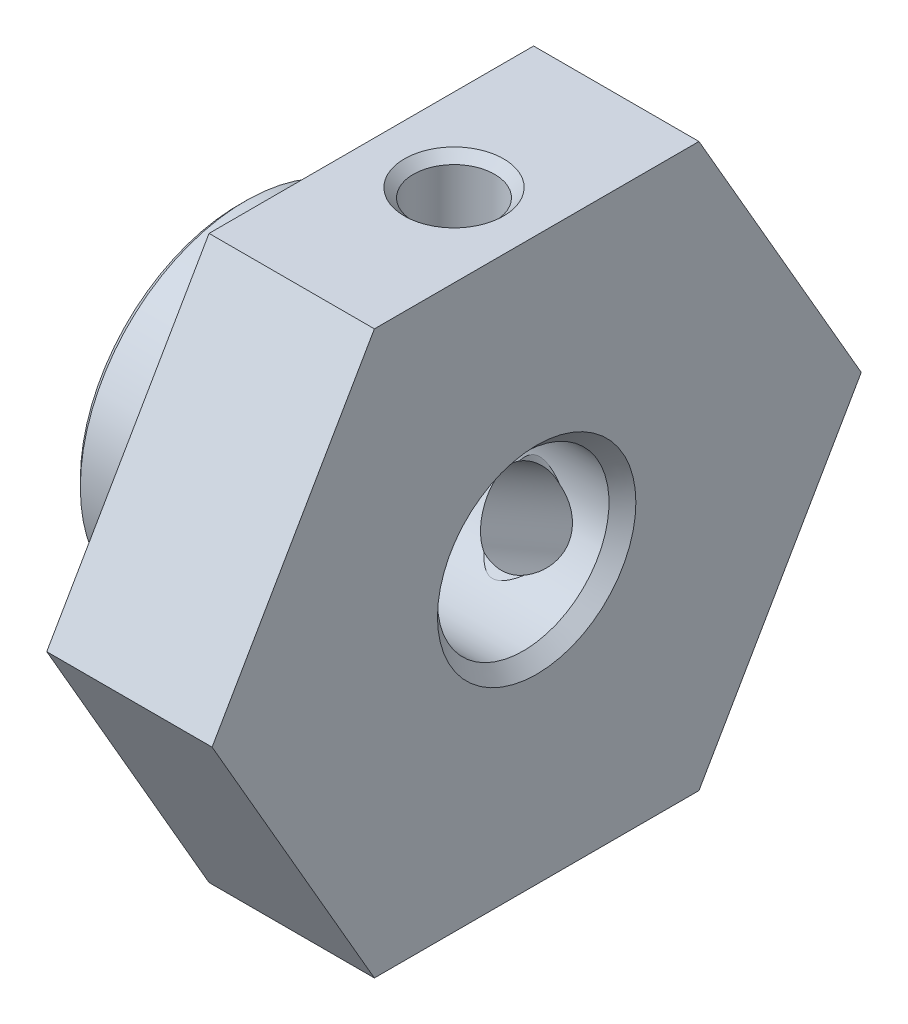
ISO-10303-21;
HEADER;
FILE_DESCRIPTION(('STEP AP214'),'2;1');
FILE_NAME('part.step','',(''),(''),'','','');
FILE_SCHEMA(('AUTOMOTIVE_DESIGN { 1 0 10303 214 1 1 1 1 }'));
ENDSEC;
DATA;
#1=APPLICATION_CONTEXT('core data for automotive mechanical design processes');
#2=APPLICATION_PROTOCOL_DEFINITION('international standard','automotive_design',2000,#1);
#3=PRODUCT_CONTEXT('',#1,'mechanical');
#4=PRODUCT('Part','Part','',(#3));
#5=PRODUCT_RELATED_PRODUCT_CATEGORY('part','',(#4));
#6=PRODUCT_DEFINITION_FORMATION('','',#4);
#7=PRODUCT_DEFINITION_CONTEXT('part definition',#1,'design');
#8=PRODUCT_DEFINITION('design','',#6,#7);
#9=PRODUCT_DEFINITION_SHAPE('','',#8);
#10=(LENGTH_UNIT() NAMED_UNIT(*) SI_UNIT(.MILLI.,.METRE.));
#11=(NAMED_UNIT(*) PLANE_ANGLE_UNIT() SI_UNIT($,.RADIAN.));
#12=(NAMED_UNIT(*) SI_UNIT($,.STERADIAN.) SOLID_ANGLE_UNIT());
#13=UNCERTAINTY_MEASURE_WITH_UNIT(LENGTH_MEASURE(1.E-05),#10,'distance_accuracy_value','');
#14=(GEOMETRIC_REPRESENTATION_CONTEXT(3) GLOBAL_UNCERTAINTY_ASSIGNED_CONTEXT((#13)) GLOBAL_UNIT_ASSIGNED_CONTEXT((#10,
#11,#12)) REPRESENTATION_CONTEXT('',''));
#15=CARTESIAN_POINT('',(0.,0.,0.));
#16=DIRECTION('',(0.,0.,1.));
#17=DIRECTION('',(1.,0.,0.));
#18=AXIS2_PLACEMENT_3D('',#15,#16,#17);
#19=CARTESIAN_POINT('',(9.,0.,0.));
#20=DIRECTION('',(-1.,0.,0.));
#21=DIRECTION('',(0.,0.,1.));
#22=AXIS2_PLACEMENT_3D('',#19,#20,#21);
#23=CYLINDRICAL_SURFACE('',#22,2.594);
#24=CARTESIAN_POINT('',(7.11130557007114,2.3645,1.06675946210943));
#25=CARTESIAN_POINT('',(7.17283329924307,2.3804229380834,1.03150297527811));
#26=CARTESIAN_POINT('',(7.23100469290972,2.39769226485528,0.991096037235716));
#27=CARTESIAN_POINT('',(7.3395891225195,2.43298344496804,0.900970580013275));
#28=CARTESIAN_POINT('',(7.3899853603298,2.45100682359714,0.851232400313027));
#29=CARTESIAN_POINT('',(7.48172195312881,2.48578882449009,0.743569384561638));
#30=CARTESIAN_POINT('',(7.52305827806804,2.50254688174719,0.685640924064241));
#31=CARTESIAN_POINT('',(7.59536277935605,2.53296409349983,0.562947576229603));
#32=CARTESIAN_POINT('',(7.62634213759102,2.54662658494757,0.498190161813476));
#33=CARTESIAN_POINT('',(7.67585190954529,2.56891442894227,0.365864181544286));
#34=CARTESIAN_POINT('',(7.69477657824279,2.57769795200646,0.298470837593822));
#35=CARTESIAN_POINT('',(7.72091963585622,2.58991766875234,0.160977536591798));
#36=CARTESIAN_POINT('',(7.72814352084603,2.59335637296332,0.0908788661333901));
#37=CARTESIAN_POINT('',(7.7304039258054,2.59442907430037,-0.0433039996482899));
#38=CARTESIAN_POINT('',(7.72646568455094,2.59255139670274,-0.107369542585981));
#39=CARTESIAN_POINT('',(7.70875145148675,2.58421839728226,-0.233802702347454));
#40=CARTESIAN_POINT('',(7.69497697513279,2.57776378062347,-0.296170579191969));
#41=CARTESIAN_POINT('',(7.65839685575418,2.56101343778478,-0.416790229436451));
#42=CARTESIAN_POINT('',(7.63570217785813,2.55076499373923,-0.475082584822805));
#43=CARTESIAN_POINT('',(7.58204880060987,2.52733331209461,-0.587114008215008));
#44=CARTESIAN_POINT('',(7.55108450547569,2.51414808827854,-0.640849960491106));
#45=CARTESIAN_POINT('',(7.47904554042583,2.48486031259046,-0.74669317815188));
#46=CARTESIAN_POINT('',(7.43737410431928,2.46861099473553,-0.798352982167304));
#47=CARTESIAN_POINT('',(7.34644987279231,2.43553938828726,-0.894175606907266));
#48=CARTESIAN_POINT('',(7.29720532396884,2.41871773825796,-0.938346473863556));
#49=CARTESIAN_POINT('',(7.20226811547265,2.38929497345709,-1.0106078768721));
#50=CARTESIAN_POINT('',(7.15773519659284,2.37650749911475,-1.04015588903911));
#51=CARTESIAN_POINT('',(7.11130557007114,2.3645,-1.06675946210943));
#52=B_SPLINE_CURVE_WITH_KNOTS('',3,(#24,#25,#26,#27,#28,#29,#30,#31,#32,#33,#34,#35,#36,#37,#38,
#39,#40,#41,#42,#43,#44,#45,#46,#47,#48,#49,#50,#51),.UNSPECIFIED.,.F.,.F.,(4,2,2,2,2,2,2,2,2,2,
2,2,2,4),(0.,0.217712384053668,0.435888737857731,0.65416194524353,0.87219872740545,
1.08267855476251,1.2930594871622,1.48475928203588,1.67642954834547,1.8657873327121,
2.05527357543357,2.25941617927635,2.46333803971736,2.62775890244638),.UNSPECIFIED.);
#53=CARTESIAN_POINT('',(7.11130557007512,2.3645000000015,1.06675946210748));
#54=VERTEX_POINT('',#53);
#55=CARTESIAN_POINT('',(7.11130557007114,2.3645,-1.06675946210943));
#56=VERTEX_POINT('',#55);
#57=EDGE_CURVE('E172',#54,#56,#52,.T.);
#58=ORIENTED_EDGE('',*,*,#57,.T.);
#59=CARTESIAN_POINT('',(7.16108783455756,2.39175,-1.00417525238377));
#60=CARTESIAN_POINT('',(7.13608003947019,2.37788866149612,-1.03721696126421));
#61=CARTESIAN_POINT('',(7.10992590509249,2.36362114904351,-1.06925485586839));
#62=CARTESIAN_POINT('',(7.05493172403082,2.33459008003922,-1.13123488475205));
#63=CARTESIAN_POINT('',(7.02607078006603,2.31982334284631,-1.16115694136222));
#64=CARTESIAN_POINT('',(6.96441720097789,2.2897399994607,-1.21944629923076));
#65=CARTESIAN_POINT('',(6.93151019585101,2.27442641614085,-1.24769511322171));
#66=CARTESIAN_POINT('',(6.86242438203194,2.24477739361206,-1.30027290179945));
#67=CARTESIAN_POINT('',(6.82625925094741,2.23043827138959,-1.32461717049315));
#68=CARTESIAN_POINT('',(6.76409894466059,2.20914823631686,-1.35968895397653));
#69=CARTESIAN_POINT('',(6.7393346976943,2.20143507415852,-1.37211049400494));
#70=CARTESIAN_POINT('',(6.6881944720094,2.187691695571,-1.39391738207763));
#71=CARTESIAN_POINT('',(6.66182937968586,2.181651389609,-1.40332098944318));
#72=CARTESIAN_POINT('',(6.61175544201868,2.172777149557,-1.41701542071826));
#73=CARTESIAN_POINT('',(6.58826998993999,2.16959093868402,-1.42187347582485));
#74=CARTESIAN_POINT('',(6.54065241512918,2.16545325011568,-1.42816790604346));
#75=CARTESIAN_POINT('',(6.51652109668275,2.16449911287724,-1.4296083533062));
#76=CARTESIAN_POINT('',(6.46831317592316,2.16499459796807,-1.42885770511199));
#77=CARTESIAN_POINT('',(6.44423667827866,2.16644719646536,-1.42666211333286));
#78=CARTESIAN_POINT('',(6.39685225175569,2.17150331242237,-1.41895370394312));
#79=CARTESIAN_POINT('',(6.3735454798292,2.17510992493096,-1.41343611294238));
#80=CARTESIAN_POINT('',(6.31675094919156,2.18617969269061,-1.39628120575765));
#81=CARTESIAN_POINT('',(6.28398523047991,2.19466919183898,-1.38296408198598));
#82=CARTESIAN_POINT('',(6.22096050541412,2.21380935145997,-1.35211561707521));
#83=CARTESIAN_POINT('',(6.19072512739402,2.22447773812005,-1.33454947719555));
#84=CARTESIAN_POINT('',(6.12945354585624,2.24810701186622,-1.29439243490119));
#85=CARTESIAN_POINT('',(6.09869150212539,2.26119101610582,-1.271462081225));
#86=CARTESIAN_POINT('',(6.0395945534333,2.28785425328316,-1.2228376503025));
#87=CARTESIAN_POINT('',(6.01126462498815,2.30143442420166,-1.19713813817876));
#88=CARTESIAN_POINT('',(5.95782296739839,2.32804903477104,-1.14449125500444));
#89=CARTESIAN_POINT('',(5.93263075741153,2.34108499624447,-1.11762577711052));
#90=CARTESIAN_POINT('',(5.88429694016077,2.36676686794831,-1.06216200520743));
#91=CARTESIAN_POINT('',(5.86114691842565,2.37941422385326,-1.03357172623689));
#92=CARTESIAN_POINT('',(5.83891216544247,2.39175000000004,-1.00417525238375));
#93=B_SPLINE_CURVE_WITH_KNOTS('',3,(#59,#60,#61,#62,#63,#64,#65,#66,#67,#68,#69,#70,#71,#72,#73,
#74,#75,#76,#77,#78,#79,#80,#81,#82,#83,#84,#85,#86,#87,#88,#89,#90,#91,#92),.UNSPECIFIED.,.F.,
.F.,(4,2,2,2,2,2,2,2,2,2,2,2,2,2,2,2,4),(0.,0.131097506093573,0.26330680666177,
0.401082051116758,0.538303705305195,0.624401304954405,0.709967715530863,0.78224515604404,
0.854436433141115,0.926717048574926,0.999101772932259,1.10760062347554,1.21702008337913,
1.33840819179224,1.46003903788386,1.57714872811023,1.69375084203825),.UNSPECIFIED.);
#94=CARTESIAN_POINT('',(5.88869442992886,2.3645,-1.06675946210943));
#95=VERTEX_POINT('',#94);
#96=EDGE_CURVE('E126',#56,#95,#93,.T.);
#97=ORIENTED_EDGE('',*,*,#96,.T.);
#98=CARTESIAN_POINT('',(5.88869442992886,2.3645,-1.06675946210943));
#99=CARTESIAN_POINT('',(5.82716670075693,2.3804229380834,-1.03150297527811));
#100=CARTESIAN_POINT('',(5.76899530709028,2.39769226485528,-0.991096037235716));
#101=CARTESIAN_POINT('',(5.6604108774805,2.43298344496804,-0.900970580013275));
#102=CARTESIAN_POINT('',(5.6100146396702,2.45100682359714,-0.851232400313027));
#103=CARTESIAN_POINT('',(5.51827804687119,2.48578882449009,-0.743569384561638));
#104=CARTESIAN_POINT('',(5.47694172193196,2.50254688174719,-0.685640924064241));
#105=CARTESIAN_POINT('',(5.40463722064395,2.53296409349983,-0.562947576229603));
#106=CARTESIAN_POINT('',(5.37365786240897,2.54662658494757,-0.498190161813476));
#107=CARTESIAN_POINT('',(5.32414809045471,2.56891442894227,-0.365864181544286));
#108=CARTESIAN_POINT('',(5.30522342175721,2.57769795200646,-0.298470837593822));
#109=CARTESIAN_POINT('',(5.27908036414378,2.58991766875234,-0.160977536591798));
#110=CARTESIAN_POINT('',(5.27185647915397,2.59335637296332,-0.0908788661333902));
#111=CARTESIAN_POINT('',(5.2695960741946,2.59442907430037,0.0433039996482899));
#112=CARTESIAN_POINT('',(5.27353431544906,2.59255139670274,0.107369542585981));
#113=CARTESIAN_POINT('',(5.29124854851325,2.58421839728226,0.233802702347454));
#114=CARTESIAN_POINT('',(5.30502302486721,2.57776378062347,0.296170579191969));
#115=CARTESIAN_POINT('',(5.34160314424582,2.56101343778478,0.416790229436451));
#116=CARTESIAN_POINT('',(5.36429782214187,2.55076499373923,0.475082584822805));
#117=CARTESIAN_POINT('',(5.41795119939013,2.52733331209461,0.587114008215008));
#118=CARTESIAN_POINT('',(5.4489154945243,2.51414808827854,0.640849960491106));
#119=CARTESIAN_POINT('',(5.52095445957417,2.48486031259046,0.74669317815188));
#120=CARTESIAN_POINT('',(5.56262589568072,2.46861099473553,0.798352982167304));
#121=CARTESIAN_POINT('',(5.65355012720769,2.43553938828726,0.894175606907266));
#122=CARTESIAN_POINT('',(5.70279467603116,2.41871773825796,0.938346473863556));
#123=CARTESIAN_POINT('',(5.79773188452735,2.38929497345709,1.0106078768721));
#124=CARTESIAN_POINT('',(5.84226480340716,2.37650749911475,1.04015588903911));
#125=CARTESIAN_POINT('',(5.88869442992886,2.3645,1.06675946210943));
#126=B_SPLINE_CURVE_WITH_KNOTS('',3,(#98,#99,#100,#101,#102,#103,#104,#105,#106,#107,#108,#109,
#110,#111,#112,#113,#114,#115,#116,#117,#118,#119,#120,#121,#122,#123,#124,#125),.UNSPECIFIED.,
.F.,.F.,(4,2,2,2,2,2,2,2,2,2,2,2,2,4),(0.,0.217712384053668,0.435888737857731,0.65416194524353,
0.87219872740545,1.0826785547625,1.2930594871622,1.48475928203588,1.67642954834547,
1.8657873327121,2.05527357543357,2.25941617927635,2.46333803971736,2.62775890244638),.UNSPECIFIED.);
#127=CARTESIAN_POINT('',(5.88869442992886,2.3645,1.06675946210943));
#128=VERTEX_POINT('',#127);
#129=EDGE_CURVE('E128',#95,#128,#126,.T.);
#130=ORIENTED_EDGE('',*,*,#129,.T.);
#131=CARTESIAN_POINT('',(5.83891216544244,2.39175,1.00417525238377));
#132=CARTESIAN_POINT('',(5.86391996052981,2.37788866149612,1.03721696126421));
#133=CARTESIAN_POINT('',(5.89007409490751,2.36362114904351,1.06925485586839));
#134=CARTESIAN_POINT('',(5.94506827596918,2.33459008003922,1.13123488475205));
#135=CARTESIAN_POINT('',(5.97392921993397,2.31982334284631,1.16115694136222));
#136=CARTESIAN_POINT('',(6.03558279902211,2.2897399994607,1.21944629923076));
#137=CARTESIAN_POINT('',(6.06848980414899,2.27442641614085,1.24769511322171));
#138=CARTESIAN_POINT('',(6.13757561796806,2.24477739361206,1.30027290179945));
#139=CARTESIAN_POINT('',(6.17374074905259,2.23043827138959,1.32461717049315));
#140=CARTESIAN_POINT('',(6.23590105533941,2.20914823631686,1.35968895397653));
#141=CARTESIAN_POINT('',(6.2606653023057,2.20143507415852,1.37211049400494));
#142=CARTESIAN_POINT('',(6.3118055279906,2.187691695571,1.39391738207763));
#143=CARTESIAN_POINT('',(6.33817062031414,2.181651389609,1.40332098944318));
#144=CARTESIAN_POINT('',(6.38824455798132,2.172777149557,1.41701542071826));
#145=CARTESIAN_POINT('',(6.41173001006001,2.16959093868402,1.42187347582485));
#146=CARTESIAN_POINT('',(6.45934758487082,2.16545325011568,1.42816790604346));
#147=CARTESIAN_POINT('',(6.48347890331725,2.16449911287724,1.4296083533062));
#148=CARTESIAN_POINT('',(6.53168682407684,2.16499459796807,1.42885770511199));
#149=CARTESIAN_POINT('',(6.55576332172134,2.16644719646536,1.42666211333286));
#150=CARTESIAN_POINT('',(6.60314774824431,2.17150331242237,1.41895370394312));
#151=CARTESIAN_POINT('',(6.6264545201708,2.17510992493096,1.41343611294238));
#152=CARTESIAN_POINT('',(6.68324905080844,2.18617969269061,1.39628120575765));
#153=CARTESIAN_POINT('',(6.71601476952009,2.19466919183898,1.38296408198598));
#154=CARTESIAN_POINT('',(6.77903949458588,2.21380935145997,1.35211561707521));
#155=CARTESIAN_POINT('',(6.80927487260598,2.22447773812005,1.33454947719555));
#156=CARTESIAN_POINT('',(6.87054645414376,2.24810701186622,1.29439243490119));
#157=CARTESIAN_POINT('',(6.90130849787461,2.26119101610582,1.271462081225));
#158=CARTESIAN_POINT('',(6.9604054465667,2.28785425328316,1.2228376503025));
#159=CARTESIAN_POINT('',(6.98873537501185,2.30143442420166,1.19713813817876));
#160=CARTESIAN_POINT('',(7.0421770326016,2.32804903477104,1.14449125500444));
#161=CARTESIAN_POINT('',(7.06736924258847,2.34108499624447,1.11762577711052));
#162=CARTESIAN_POINT('',(7.11570305983923,2.36676686794831,1.06216200520743));
#163=CARTESIAN_POINT('',(7.13885308157434,2.37941422385326,1.03357172623689));
#164=CARTESIAN_POINT('',(7.16108783455752,2.39175000000004,1.00417525238375));
#165=B_SPLINE_CURVE_WITH_KNOTS('',3,(#131,#132,#133,#134,#135,#136,#137,#138,#139,#140,#141,
#142,#143,#144,#145,#146,#147,#148,#149,#150,#151,#152,#153,#154,#155,#156,#157,#158,#159,#160,
#161,#162,#163,#164),.UNSPECIFIED.,.F.,.F.,(4,2,2,2,2,2,2,2,2,2,2,2,2,2,2,2,4),(0.,
0.131097506093572,0.26330680666177,0.401082051116758,0.538303705305195,0.624401304954403,
0.709967715530863,0.78224515604404,0.854436433141115,0.926717048574927,0.999101772932259,
1.10760062347554,1.21702008337913,1.33840819179224,1.46003903788386,1.57714872811023,
1.69375084203825),.UNSPECIFIED.);
#166=EDGE_CURVE('E165',#128,#54,#165,.T.);
#167=ORIENTED_EDGE('',*,*,#166,.T.);
#168=EDGE_LOOP('',(#58,#97,#130,#167));
#169=FACE_BOUND('',#168,.T.);
#170=CARTESIAN_POINT('',(0.406,0.,0.));
#171=DIRECTION('',(-1.,0.,0.));
#172=DIRECTION('',(0.,0.,1.));
#173=AXIS2_PLACEMENT_3D('',#170,#171,#172);
#174=CIRCLE('',#173,2.594);
#175=CARTESIAN_POINT('',(0.406,0.,2.594));
#176=VERTEX_POINT('',#175);
#177=EDGE_CURVE('E242',#176,#176,#174,.T.);
#178=ORIENTED_EDGE('',*,*,#177,.T.);
#179=EDGE_LOOP('',(#178));
#180=FACE_BOUND('',#179,.T.);
#181=CARTESIAN_POINT('',(8.594,0.,0.));
#182=DIRECTION('',(-1.,0.,0.));
#183=DIRECTION('',(0.,0.,1.));
#184=AXIS2_PLACEMENT_3D('',#181,#182,#183);
#185=CIRCLE('',#184,2.594);
#186=CARTESIAN_POINT('',(8.594,0.,2.594));
#187=VERTEX_POINT('',#186);
#188=EDGE_CURVE('E239',#187,#187,#185,.T.);
#189=ORIENTED_EDGE('',*,*,#188,.F.);
#190=EDGE_LOOP('',(#189));
#191=FACE_BOUND('',#190,.T.);
#192=CARTESIAN_POINT('',(5.88869442992874,-2.10609079391417,-1.51433733619361));
#193=CARTESIAN_POINT('',(5.82716670075681,-2.08351924971175,-1.54575524849239));
#194=CARTESIAN_POINT('',(5.76899530709017,-2.05716047826383,-1.5809143932043));
#195=CARTESIAN_POINT('',(5.66041087748039,-1.99675513283788,-1.65654018032271));
#196=CARTESIAN_POINT('',(5.6100146396701,-1.96269229499402,-1.69701797392766));
#197=CARTESIAN_POINT('',(5.5182780468711,-1.88684438875173,-1.78097157817111));
#198=CARTESIAN_POINT('',(5.47694172193187,-1.84505589898741,-1.82444871172253));
#199=CARTESIAN_POINT('',(5.40463722064387,-1.75400894876356,-1.91213746372993));
#200=CARTESIAN_POINT('',(5.3736578624089,-1.70475862851967,-1.95634823561073));
#201=CARTESIAN_POINT('',(5.32414809045465,-1.60130489002321,-2.04181306484032));
#202=CARTESIAN_POINT('',(5.30522342175715,-1.54733230364822,-2.08311649092387));
#203=CARTESIAN_POINT('',(5.27908036414373,-1.43436947050322,-2.16244572655386));
#204=CARTESIAN_POINT('',(5.27185647915394,-1.37538159322021,-2.20047306698586));
#205=CARTESIAN_POINT('',(5.26959607419458,-1.2597121733692,-2.26849348648526));
#206=CARTESIAN_POINT('',(5.27353431544904,-1.2032909468791,-2.29890014145443));
#207=CARTESIAN_POINT('',(5.29124854851325,-1.08963011893469,-2.35490013214732));
#208=CARTESIAN_POINT('',(5.30502302486721,-1.03239064487785,-2.38049420857136));
#209=CARTESIAN_POINT('',(5.34160314424583,-0.919555792151185,-2.4262978112732));
#210=CARTESIAN_POINT('',(5.36429782214189,-0.863948909517396,-2.44656857607366));
#211=CARTESIAN_POINT('',(5.41795119939015,-0.75521101001531,-2.48229185621213));
#212=CARTESIAN_POINT('',(5.44891549452433,-0.702081698339623,-2.49774109357087));
#213=CARTESIAN_POINT('',(5.52095445957421,-0.595774895183066,-2.52529874463504));
#214=CARTESIAN_POINT('',(5.56262589568077,-0.542911533623723,-2.53705632458622));
#215=CARTESIAN_POINT('',(5.65355012720775,-0.443390903117478,-2.55632678562803));
#216=CARTESIAN_POINT('',(5.70279467603122,-0.396726985211499,-2.56384424284722));
#217=CARTESIAN_POINT('',(5.79773188452737,-0.319435392092613,-2.57449408258436));
#218=CARTESIAN_POINT('',(5.84226480340712,-0.287452325753515,-2.57819381103715));
#219=CARTESIAN_POINT('',(5.88869442992876,-0.258409206085846,-2.58109679830302));
#220=B_SPLINE_CURVE_WITH_KNOTS('',3,(#192,#193,#194,#195,#196,#197,#198,#199,#200,#201,#202,
#203,#204,#205,#206,#207,#208,#209,#210,#211,#212,#213,#214,#215,#216,#217,#218,#219),
.UNSPECIFIED.,.F.,.F.,(4,2,2,2,2,2,2,2,2,2,2,2,2,4),(0.,0.217712384053673,0.43588873785774,
0.654161945243546,0.872198727405472,1.08267855476253,1.29305948716222,1.4847592820359,
1.67642954834549,1.86578733271212,2.0552735754336,2.25941617927639,2.46333803971741,
2.62775890244621),.UNSPECIFIED.);
#221=CARTESIAN_POINT('',(5.88869442992875,-2.10609079391417,-1.51433733619361));
#222=VERTEX_POINT('',#221);
#223=CARTESIAN_POINT('',(5.88869442992877,-0.258409206085846,-2.58109679830302));
#224=VERTEX_POINT('',#223);
#225=EDGE_CURVE('E36',#222,#224,#220,.T.);
#226=ORIENTED_EDGE('',*,*,#225,.T.);
#227=CARTESIAN_POINT('',(5.50388304550991,-1.19846727659727,-2.30054606276984));
#228=CARTESIAN_POINT('',(5.50938658718427,-1.12780388006646,-2.33736036512866));
#229=CARTESIAN_POINT('',(5.52075950437193,-1.05580573698441,-2.37069570186363));
#230=CARTESIAN_POINT('',(5.55445603871214,-0.911344337720269,-2.42989432286393));
#231=CARTESIAN_POINT('',(5.57678044166135,-0.838881048531043,-2.45575707074057));
#232=CARTESIAN_POINT('',(5.63167585515638,-0.694083566807484,-2.50058894573353));
#233=CARTESIAN_POINT('',(5.66443280749854,-0.621777776780946,-2.51941833114112));
#234=CARTESIAN_POINT('',(5.73889207994243,-0.480229880400842,-2.55018945708196));
#235=CARTESIAN_POINT('',(5.78061110835065,-0.410993791897899,-2.56211817693569));
#236=CARTESIAN_POINT('',(5.86976633748097,-0.281058229906232,-2.57951777599928));
#237=CARTESIAN_POINT('',(5.91676748632418,-0.220099202924344,-2.58530495009201));
#238=CARTESIAN_POINT('',(6.01836587288765,-0.104696004820024,-2.59251819779675));
#239=CARTESIAN_POINT('',(6.07293223651213,-0.0502269480144484,-2.59396148122718));
#240=CARTESIAN_POINT('',(6.15679469581257,0.0182494878553374,-2.59401504855953));
#241=CARTESIAN_POINT('',(6.18204559161179,0.0371928396139645,-2.59379323975599));
#242=CARTESIAN_POINT('',(6.23453140957459,0.0722389387559833,-2.59305249510194));
#243=CARTESIAN_POINT('',(6.26176864280721,0.0883383002367059,-2.59253320816779));
#244=CARTESIAN_POINT('',(6.31886596983016,0.11662597156985,-2.59141641883817));
#245=CARTESIAN_POINT('',(6.34876308281246,0.128742344187686,-2.59081772605639));
#246=CARTESIAN_POINT('',(6.41034223429755,0.146694606206253,-2.58986547449518));
#247=CARTESIAN_POINT('',(6.44201414258028,0.152562944472351,-2.58951065262786));
#248=CARTESIAN_POINT('',(6.50142893432492,0.156378778077344,-2.58928257309613));
#249=CARTESIAN_POINT('',(6.52910705003063,0.155312556741193,-2.58934931459801));
#250=CARTESIAN_POINT('',(6.58373903723086,0.147757711561433,-2.58979080751506));
#251=CARTESIAN_POINT('',(6.61069087815919,0.141255243951483,-2.59016634526042));
#252=CARTESIAN_POINT('',(6.66983239741282,0.121709553937841,-2.59116520775294));
#253=CARTESIAN_POINT('',(6.70159357512015,0.10741689414535,-2.59182737457315));
#254=CARTESIAN_POINT('',(6.76262501858673,0.0742554936079364,-2.59299076721768));
#255=CARTESIAN_POINT('',(6.79188751956752,0.0553731428855056,-2.59349150387871));
#256=CARTESIAN_POINT('',(6.87483874635658,-0.00465923563397107,-2.594294065667));
#257=CARTESIAN_POINT('',(6.92547206048663,-0.0499871778791355,-2.59396052470188));
#258=CARTESIAN_POINT('',(7.02037389992108,-0.146706839757141,-2.59030950239663));
#259=CARTESIAN_POINT('',(7.06462424599979,-0.198115148381107,-2.58698368619891));
#260=CARTESIAN_POINT('',(7.16524768516267,-0.328010263446798,-2.57432018847834));
#261=CARTESIAN_POINT('',(7.21865474146075,-0.408637456261522,-2.56301272162989));
#262=CARTESIAN_POINT('',(7.31323221855682,-0.575002396326974,-2.53088525971234));
#263=CARTESIAN_POINT('',(7.354413655856,-0.660735458513977,-2.51007387181776));
#264=CARTESIAN_POINT('',(7.4054165264933,-0.790767334256604,-2.47094443167833));
#265=CARTESIAN_POINT('',(7.42059506794787,-0.834226582290715,-2.45663348346034));
#266=CARTESIAN_POINT('',(7.44717723989209,-0.921316693357848,-2.4253140594609));
#267=CARTESIAN_POINT('',(7.45858291598971,-0.964947450372153,-2.40830705287788));
#268=CARTESIAN_POINT('',(7.47736949446926,-1.05190744955163,-2.37161348351385));
#269=CARTESIAN_POINT('',(7.4847539816185,-1.09523692616173,-2.35192932696269));
#270=CARTESIAN_POINT('',(7.49533954504221,-1.18113501037105,-2.3099881760236));
#271=CARTESIAN_POINT('',(7.49854141218817,-1.22370376031054,-2.28773166889564));
#272=CARTESIAN_POINT('',(7.50140059252727,-1.33693882844688,-2.2244245165888));
#273=CARTESIAN_POINT('',(7.49702686385575,-1.40648938222507,-2.18109440005667));
#274=CARTESIAN_POINT('',(7.47623429298484,-1.53988790240963,-2.08905839427344));
#275=CARTESIAN_POINT('',(7.45981888005489,-1.60373748655067,-2.04035403886947));
#276=CARTESIAN_POINT('',(7.41675044280397,-1.72253002746755,-1.94101434307772));
#277=CARTESIAN_POINT('',(7.39043826413837,-1.77769108396697,-1.89048907631685));
#278=CARTESIAN_POINT('',(7.32871479532358,-1.88103524808331,-1.78769874701476));
#279=CARTESIAN_POINT('',(7.29328445804734,-1.92920341460601,-1.7354302443684));
#280=CARTESIAN_POINT('',(7.20864637586031,-2.02477039323396,-1.62336955294946));
#281=CARTESIAN_POINT('',(7.15818828368042,-2.07105514358823,-1.56358008897954));
#282=CARTESIAN_POINT('',(7.0472515593227,-2.15411494972569,-1.4469484832729));
#283=CARTESIAN_POINT('',(6.98681079326088,-2.19092464535363,-1.39009623102624));
#284=CARTESIAN_POINT('',(6.89546554233853,-2.23414530993516,-1.31831875452906));
#285=CARTESIAN_POINT('',(6.86980560176188,-2.24514437622687,-1.29945731435571));
#286=CARTESIAN_POINT('',(6.81641227594555,-2.26545497527008,-1.26371210745799));
#287=CARTESIAN_POINT('',(6.78867580249852,-2.27476392113205,-1.24683138614895));
#288=CARTESIAN_POINT('',(6.73044912983819,-2.29140966392054,-1.21597247140285));
#289=CARTESIAN_POINT('',(6.69992412305579,-2.29871508517318,-1.20204115823092));
#290=CARTESIAN_POINT('',(6.63650877083502,-2.31043056220542,-1.17937026092893));
#291=CARTESIAN_POINT('',(6.60363144357371,-2.31485536385734,-1.17060425787367));
#292=CARTESIAN_POINT('',(6.54664096341902,-2.31925978064492,-1.16184597314974));
#293=CARTESIAN_POINT('',(6.52289006436462,-2.32017995015027,-1.16000024917419));
#294=CARTESIAN_POINT('',(6.4753922997572,-2.32013377113395,-1.16009297484064));
#295=CARTESIAN_POINT('',(6.45164543459351,-2.31916729296768,-1.16203168453724));
#296=CARTESIAN_POINT('',(6.40500313751318,-2.31547993768403,-1.16936040333008));
#297=CARTESIAN_POINT('',(6.38210351052346,-2.31276943974,-1.17472999294415));
#298=CARTESIAN_POINT('',(6.33737081523047,-2.30586439076894,-1.18822695571065));
#299=CARTESIAN_POINT('',(6.31553909000592,-2.30166802297481,-1.19635770442096));
#300=CARTESIAN_POINT('',(6.2537627825803,-2.28770230098629,-1.22296111257678));
#301=CARTESIAN_POINT('',(6.21535751602213,-2.27633112918433,-1.24412352645921));
#302=CARTESIAN_POINT('',(6.14222948466012,-2.25037198542233,-1.29049735975172));
#303=CARTESIAN_POINT('',(6.10752419803911,-2.23576966826185,-1.31572669486573));
#304=CARTESIAN_POINT('',(6.01036737790214,-2.18912578745977,-1.39285687969818));
#305=CARTESIAN_POINT('',(5.95204874724074,-2.1534742466467,-1.44778521259614));
#306=CARTESIAN_POINT('',(5.84486460281243,-2.0734543007809,-1.56027382466045));
#307=CARTESIAN_POINT('',(5.79600765752655,-2.02907806726344,-1.61783643164762));
#308=CARTESIAN_POINT('',(5.70572514856655,-1.9289594899344,-1.7361607294405));
#309=CARTESIAN_POINT('',(5.66482993017413,-1.87273979536294,-1.79693045242447));
#310=CARTESIAN_POINT('',(5.59551419361413,-1.7508193018726,-1.9159072139838));
#311=CARTESIAN_POINT('',(5.5670717048343,-1.68513547517408,-1.97411860164986));
#312=CARTESIAN_POINT('',(5.5263914975018,-1.55158815621048,-2.08038873834185));
#313=CARTESIAN_POINT('',(5.5129229038839,-1.4844564542154,-2.12888962567836));
#314=CARTESIAN_POINT('',(5.49879162973605,-1.34485822011007,-2.21971043419646));
#315=CARTESIAN_POINT('',(5.49812540791056,-1.27239316883823,-2.2620320614238));
#316=CARTESIAN_POINT('',(5.50388304550991,-1.19846727659727,-2.30054606276984));
#317=B_SPLINE_CURVE_WITH_KNOTS('',3,(#227,#228,#229,#230,#231,#232,#233,#234,#235,#236,#237,
#238,#239,#240,#241,#242,#243,#244,#245,#246,#247,#248,#249,#250,#251,#252,#253,#254,#255,#256,
#257,#258,#259,#260,#261,#262,#263,#264,#265,#266,#267,#268,#269,#270,#271,#272,#273,#274,#275,
#276,#277,#278,#279,#280,#281,#282,#283,#284,#285,#286,#287,#288,#289,#290,#291,#292,#293,#294,
#295,#296,#297,#298,#299,#300,#301,#302,#303,#304,#305,#306,#307,#308,#309,#310,#311,#312,#313,
#314,#315,#316),.UNSPECIFIED.,.T.,.F.,(4,2,2,2,2,2,2,2,2,2,2,2,2,2,2,2,2,2,2,2,2,2,2,2,2,2,2,2,
2,2,2,2,2,2,2,2,2,2,2,2,2,2,2,2,4),(0.,0.239300058686465,0.47861729026632,0.72246411866859,
0.96676956682028,1.19777107932289,1.42785618708638,1.52242606053374,1.61710777594648,
1.71341598754335,1.80922155017143,1.89173042071522,1.97445004793376,2.07837553909921,
2.18261304671379,2.38537541478556,2.5887043234839,2.87944057938397,3.16991405215037,
3.31434579583269,3.45869910129194,3.60292350862839,3.74712064131635,3.9919130405994,
4.23663575416903,4.47360471365719,4.71107275874781,4.98280845832145,5.25353613863652,
5.35450132516364,5.45561976911196,5.55824146007192,5.66033361227279,5.73149766053133,
5.80266659913577,5.87341585959502,5.94425192531215,6.0793621027165,6.21508460876966,
6.47673458229083,6.73862040863939,7.01437045680036,7.28963201333321,7.54004971258633,
7.79039814218663),.UNSPECIFIED.);
#318=CARTESIAN_POINT('',(7.11130557007123,-0.258409206085846,-2.58109679830302));
#319=VERTEX_POINT('',#318);
#320=EDGE_CURVE('E11',#224,#319,#317,.T.);
#321=ORIENTED_EDGE('',*,*,#320,.T.);
#322=CARTESIAN_POINT('',(7.11130557007124,-0.258409206085846,-2.58109679830302));
#323=CARTESIAN_POINT('',(7.17283329924317,-0.296903688371672,-2.57725822377046));
#324=CARTESIAN_POINT('',(7.23100469290982,-0.340531786591469,-2.57201043043997));
#325=CARTESIAN_POINT('',(7.33958912251959,-0.43622831213018,-2.55751076033593));
#326=CARTESIAN_POINT('',(7.38998536032989,-0.488314528603148,-2.54825037424063));
#327=CARTESIAN_POINT('',(7.48172195312889,-0.598944435738375,-2.52454096273268));
#328=CARTESIAN_POINT('',(7.52305827806811,-0.6574909827598,-2.5100896357867));
#329=CARTESIAN_POINT('',(7.59536277935612,-0.778955144736284,-2.47508503995945));
#330=CARTESIAN_POINT('',(7.62634213759109,-0.841867956427923,-2.45453839742412));
#331=CARTESIAN_POINT('',(7.67585190954535,-0.967609538919069,-2.40767724638451));
#332=CARTESIAN_POINT('',(7.69477657824285,-1.03036564835825,-2.38158732851759));
#333=CARTESIAN_POINT('',(7.72091963585626,-1.15554819824912,-2.32342326314555));
#334=CARTESIAN_POINT('',(7.72814352084606,-1.21797477974311,-2.29135193311915));
#335=CARTESIAN_POINT('',(7.73040392580542,-1.33471690093116,-2.22518948683687));
#336=CARTESIAN_POINT('',(7.72646568455096,-1.38926044982363,-2.19153059886835));
#337=CARTESIAN_POINT('',(7.70875145148676,-1.49458827834756,-2.12109742979976));
#338=CARTESIAN_POINT('',(7.69497697513279,-1.54537313574561,-2.0843236293793));
#339=CARTESIAN_POINT('',(7.65839685575418,-1.64145764563358,-2.00950758183665));
#340=CARTESIAN_POINT('',(7.63570217785812,-1.68681608422181,-1.97148599125076));
#341=CARTESIAN_POINT('',(7.58204880060986,-1.77212230207928,-1.89517784799703));
#342=CARTESIAN_POINT('',(7.55108450547568,-1.81206638993889,-1.85689113307967));
#343=CARTESIAN_POINT('',(7.4790455404258,-1.88908541740736,-1.77860556648306));
#344=CARTESIAN_POINT('',(7.43737410431924,-1.92569946111178,-1.73870334241882));
#345=CARTESIAN_POINT('',(7.34644987279226,-1.99214848516975,-1.66215117872067));
#346=CARTESIAN_POINT('',(7.29720532396879,-2.02199075304643,-1.62549776898358));
#347=CARTESIAN_POINT('',(7.20226811547264,-2.06985958136446,-1.56388620571222));
#348=CARTESIAN_POINT('',(7.15773519659289,-2.08905517336124,-1.53803792199804));
#349=CARTESIAN_POINT('',(7.11130557007126,-2.10609079391417,-1.51433733619361));
#350=B_SPLINE_CURVE_WITH_KNOTS('',3,(#322,#323,#324,#325,#326,#327,#328,#329,#330,#331,#332,
#333,#334,#335,#336,#337,#338,#339,#340,#341,#342,#343,#344,#345,#346,#347,#348,#349),
.UNSPECIFIED.,.F.,.F.,(4,2,2,2,2,2,2,2,2,2,2,2,2,4),(0.,0.217712384053673,0.43588873785774,
0.654161945243546,0.872198727405471,1.08267855476253,1.29305948716222,1.4847592820359,
1.67642954834549,1.86578733271213,2.0552735754336,2.25941617927639,2.46333803971741,
2.62775890244621),.UNSPECIFIED.);
#351=CARTESIAN_POINT('',(7.11130557007125,-2.10609079391417,-1.51433733619361));
#352=VERTEX_POINT('',#351);
#353=EDGE_CURVE('E116',#319,#352,#350,.T.);
#354=ORIENTED_EDGE('',*,*,#353,.T.);
#355=EDGE_CURVE('E47',#352,#222,#317,.T.);
#356=ORIENTED_EDGE('',*,*,#355,.T.);
#357=EDGE_LOOP('',(#226,#321,#354,#356));
#358=FACE_BOUND('',#357,.T.);
#359=ADVANCED_FACE('F32',(#169,#180,#191,#358),#23,.F.);
#360=CARTESIAN_POINT('',(9.,-8.5,-4.9074772881118));
#361=DIRECTION('',(0.,0.499999999999999,0.866025403784439));
#362=DIRECTION('',(0.,-0.866025403784439,0.499999999999999));
#363=AXIS2_PLACEMENT_3D('',#360,#361,#362);
#364=PLANE('',#363);
#365=DIRECTION('',(-1.,0.,0.));
#366=VECTOR('',#365,1.);
#367=CARTESIAN_POINT('',(9.,0.,-9.8149545762236));
#368=LINE('',#367,#366);
#369=CARTESIAN_POINT('',(9.,0.,-9.8149545762236));
#370=VERTEX_POINT('',#369);
#371=CARTESIAN_POINT('',(4.,0.,-9.8149545762236));
#372=VERTEX_POINT('',#371);
#373=EDGE_CURVE('E224',#370,#372,#368,.T.);
#374=ORIENTED_EDGE('',*,*,#373,.F.);
#375=DIRECTION('',(0.,0.866025403784439,-0.499999999999999));
#376=VECTOR('',#375,1.);
#377=CARTESIAN_POINT('',(9.,-8.5,-4.9074772881118));
#378=LINE('',#377,#376);
#379=CARTESIAN_POINT('',(9.,-8.5,-4.9074772881118));
#380=VERTEX_POINT('',#379);
#381=EDGE_CURVE('E210',#380,#370,#378,.T.);
#382=ORIENTED_EDGE('',*,*,#381,.F.);
#383=DIRECTION('',(-1.,0.,0.));
#384=VECTOR('',#383,1.);
#385=CARTESIAN_POINT('',(9.,-8.5,-4.9074772881118));
#386=LINE('',#385,#384);
#387=CARTESIAN_POINT('',(4.,-8.5,-4.9074772881118));
#388=VERTEX_POINT('',#387);
#389=EDGE_CURVE('E227',#380,#388,#386,.T.);
#390=ORIENTED_EDGE('',*,*,#389,.T.);
#391=DIRECTION('',(0.,-0.866025403784439,0.499999999999999));
#392=VECTOR('',#391,1.);
#393=CARTESIAN_POINT('',(4.,-0.499999999999969,-9.52627944162881));
#394=LINE('',#393,#392);
#395=EDGE_CURVE('E263',#372,#388,#394,.T.);
#396=ORIENTED_EDGE('',*,*,#395,.F.);
#397=EDGE_LOOP('',(#374,#382,#390,#396));
#398=FACE_BOUND('',#397,.T.);
#399=CARTESIAN_POINT('',(6.5,-4.25000000000001,-7.36121593216772));
#400=DIRECTION('',(0.,-0.500000000000001,-0.866025403784438));
#401=DIRECTION('',(0.,0.866025403784438,-0.500000000000001));
#402=AXIS2_PLACEMENT_3D('',#399,#400,#401);
#403=CIRCLE('',#402,1.50000000000004);
#404=CARTESIAN_POINT('',(6.5,-2.95096189432332,-8.11121593216774));
#405=VERTEX_POINT('',#404);
#406=EDGE_CURVE('E195',#405,#405,#403,.T.);
#407=ORIENTED_EDGE('',*,*,#406,.F.);
#408=EDGE_LOOP('',(#407));
#409=FACE_BOUND('',#408,.T.);
#410=ADVANCED_FACE('F293',(#398,#409),#364,.F.);
#411=CARTESIAN_POINT('',(9.,8.5,-4.9074772881118));
#412=DIRECTION('',(0.,-1.,0.));
#413=DIRECTION('',(0.,0.,-1.));
#414=AXIS2_PLACEMENT_3D('',#411,#412,#413);
#415=PLANE('',#414);
#416=DIRECTION('',(-1.,0.,0.));
#417=VECTOR('',#416,1.);
#418=CARTESIAN_POINT('',(9.,8.5,4.9074772881118));
#419=LINE('',#418,#417);
#420=CARTESIAN_POINT('',(9.,8.5,4.9074772881118));
#421=VERTEX_POINT('',#420);
#422=CARTESIAN_POINT('',(4.,8.5,4.9074772881118));
#423=VERTEX_POINT('',#422);
#424=EDGE_CURVE('E219',#421,#423,#419,.T.);
#425=ORIENTED_EDGE('',*,*,#424,.F.);
#426=DIRECTION('',(0.,0.,1.));
#427=VECTOR('',#426,1.);
#428=CARTESIAN_POINT('',(9.,8.5,-4.9074772881118));
#429=LINE('',#428,#427);
#430=CARTESIAN_POINT('',(9.,8.5,-4.9074772881118));
#431=VERTEX_POINT('',#430);
#432=EDGE_CURVE('E216',#431,#421,#429,.T.);
#433=ORIENTED_EDGE('',*,*,#432,.F.);
#434=DIRECTION('',(-1.,0.,0.));
#435=VECTOR('',#434,1.);
#436=CARTESIAN_POINT('',(9.,8.5,-4.9074772881118));
#437=LINE('',#436,#435);
#438=CARTESIAN_POINT('',(4.,8.5,-4.9074772881118));
#439=VERTEX_POINT('',#438);
#440=EDGE_CURVE('E222',#431,#439,#437,.T.);
#441=ORIENTED_EDGE('',*,*,#440,.T.);
#442=DIRECTION('',(0.,0.,-1.));
#443=VECTOR('',#442,1.);
#444=CARTESIAN_POINT('',(4.,8.5,0.));
#445=LINE('',#444,#443);
#446=EDGE_CURVE('E257',#423,#439,#445,.T.);
#447=ORIENTED_EDGE('',*,*,#446,.F.);
#448=EDGE_LOOP('',(#425,#433,#441,#447));
#449=FACE_BOUND('',#448,.T.);
#450=CARTESIAN_POINT('',(6.5,8.5,0.));
#451=DIRECTION('',(0.,1.,0.));
#452=DIRECTION('',(0.,0.,1.));
#453=AXIS2_PLACEMENT_3D('',#450,#451,#452);
#454=CIRCLE('',#453,1.5);
#455=CARTESIAN_POINT('',(6.5,8.5,1.5));
#456=VERTEX_POINT('',#455);
#457=EDGE_CURVE('E193',#456,#456,#454,.T.);
#458=ORIENTED_EDGE('',*,*,#457,.F.);
#459=EDGE_LOOP('',(#458));
#460=FACE_BOUND('',#459,.T.);
#461=ADVANCED_FACE('F286',(#449,#460),#415,.F.);
#462=CARTESIAN_POINT('',(0.,0.,0.));
#463=DIRECTION('',(1.,0.,0.));
#464=DIRECTION('',(0.,0.,-1.));
#465=AXIS2_PLACEMENT_3D('',#462,#463,#464);
#466=PLANE('',#465);
#467=CARTESIAN_POINT('',(0.,0.,0.));
#468=DIRECTION('',(-1.,0.,0.));
#469=DIRECTION('',(0.,0.,1.));
#470=AXIS2_PLACEMENT_3D('',#467,#468,#469);
#471=CIRCLE('',#470,4.8);
#472=CARTESIAN_POINT('',(0.,0.,4.8));
#473=VERTEX_POINT('',#472);
#474=EDGE_CURVE('E254',#473,#473,#471,.T.);
#475=ORIENTED_EDGE('',*,*,#474,.T.);
#476=EDGE_LOOP('',(#475));
#477=FACE_BOUND('',#476,.T.);
#478=CARTESIAN_POINT('',(0.,0.,0.));
#479=DIRECTION('',(-1.,0.,0.));
#480=DIRECTION('',(0.,0.,1.));
#481=AXIS2_PLACEMENT_3D('',#478,#479,#480);
#482=CIRCLE('',#481,3.);
#483=CARTESIAN_POINT('',(0.,0.,3.));
#484=VERTEX_POINT('',#483);
#485=EDGE_CURVE('E245',#484,#484,#482,.T.);
#486=ORIENTED_EDGE('',*,*,#485,.F.);
#487=EDGE_LOOP('',(#486));
#488=FACE_BOUND('',#487,.T.);
#489=ADVANCED_FACE('F34',(#477,#488),#466,.F.);
#490=CARTESIAN_POINT('',(9.,10.2,0.));
#491=DIRECTION('',(-1.,0.,0.));
#492=DIRECTION('',(0.,0.,1.));
#493=AXIS2_PLACEMENT_3D('',#490,#491,#492);
#494=PLANE('',#493);
#495=ORIENTED_EDGE('',*,*,#432,.T.);
#496=DIRECTION('',(0.,-0.866025403784439,0.499999999999999));
#497=VECTOR('',#496,1.);
#498=CARTESIAN_POINT('',(9.,8.5,4.9074772881118));
#499=LINE('',#498,#497);
#500=CARTESIAN_POINT('',(9.,0.,9.8149545762236));
#501=VERTEX_POINT('',#500);
#502=EDGE_CURVE('E201',#421,#501,#499,.T.);
#503=ORIENTED_EDGE('',*,*,#502,.T.);
#504=DIRECTION('',(0.,-0.866025403784439,-0.499999999999999));
#505=VECTOR('',#504,1.);
#506=CARTESIAN_POINT('',(9.,0.,9.8149545762236));
#507=LINE('',#506,#505);
#508=CARTESIAN_POINT('',(9.,-8.5,4.9074772881118));
#509=VERTEX_POINT('',#508);
#510=EDGE_CURVE('E204',#501,#509,#507,.T.);
#511=ORIENTED_EDGE('',*,*,#510,.T.);
#512=DIRECTION('',(0.,0.,-1.));
#513=VECTOR('',#512,1.);
#514=CARTESIAN_POINT('',(9.,-8.5,4.9074772881118));
#515=LINE('',#514,#513);
#516=EDGE_CURVE('E207',#509,#380,#515,.T.);
#517=ORIENTED_EDGE('',*,*,#516,.T.);
#518=ORIENTED_EDGE('',*,*,#381,.T.);
#519=DIRECTION('',(0.,0.866025403784439,0.499999999999999));
#520=VECTOR('',#519,1.);
#521=CARTESIAN_POINT('',(9.,0.,-9.8149545762236));
#522=LINE('',#521,#520);
#523=EDGE_CURVE('E213',#370,#431,#522,.T.);
#524=ORIENTED_EDGE('',*,*,#523,.T.);
#525=EDGE_LOOP('',(#495,#503,#511,#517,#518,#524));
#526=FACE_BOUND('',#525,.T.);
#527=CARTESIAN_POINT('',(9.,0.,0.));
#528=DIRECTION('',(-1.,0.,0.));
#529=DIRECTION('',(0.,0.,1.));
#530=AXIS2_PLACEMENT_3D('',#527,#528,#529);
#531=CIRCLE('',#530,3.);
#532=CARTESIAN_POINT('',(9.,0.,3.));
#533=VERTEX_POINT('',#532);
#534=EDGE_CURVE('E236',#533,#533,#531,.T.);
#535=ORIENTED_EDGE('',*,*,#534,.T.);
#536=EDGE_LOOP('',(#535));
#537=FACE_BOUND('',#536,.T.);
#538=ADVANCED_FACE('F282',(#526,#537),#494,.F.);
#539=CARTESIAN_POINT('',(0.200000000000001,0.,0.));
#540=DIRECTION('',(1.,0.,0.));
#541=DIRECTION('',(0.,0.,-1.));
#542=AXIS2_PLACEMENT_3D('',#539,#540,#541);
#543=CONICAL_SURFACE('',#542,5.,0.785398163397448);
#544=ORIENTED_EDGE('',*,*,#474,.F.);
#545=EDGE_LOOP('',(#544));
#546=FACE_BOUND('',#545,.T.);
#547=CARTESIAN_POINT('',(0.200000000000001,0.,0.));
#548=DIRECTION('',(-1.,0.,0.));
#549=DIRECTION('',(0.,0.,1.));
#550=AXIS2_PLACEMENT_3D('',#547,#548,#549);
#551=CIRCLE('',#550,5.);
#552=CARTESIAN_POINT('',(0.200000000000001,0.,5.));
#553=VERTEX_POINT('',#552);
#554=EDGE_CURVE('E251',#553,#553,#551,.T.);
#555=ORIENTED_EDGE('',*,*,#554,.T.);
#556=EDGE_LOOP('',(#555));
#557=FACE_BOUND('',#556,.T.);
#558=ADVANCED_FACE('F357',(#546,#557),#543,.T.);
#559=CARTESIAN_POINT('',(9.,0.,0.));
#560=DIRECTION('',(-1.,0.,0.));
#561=DIRECTION('',(0.,0.,1.));
#562=AXIS2_PLACEMENT_3D('',#559,#560,#561);
#563=CYLINDRICAL_SURFACE('',#562,5.);
#564=ORIENTED_EDGE('',*,*,#554,.F.);
#565=EDGE_LOOP('',(#564));
#566=FACE_BOUND('',#565,.T.);
#567=CARTESIAN_POINT('',(4.,0.,0.));
#568=DIRECTION('',(-1.,0.,0.));
#569=DIRECTION('',(0.,0.,1.));
#570=AXIS2_PLACEMENT_3D('',#567,#568,#569);
#571=CIRCLE('',#570,5.);
#572=CARTESIAN_POINT('',(4.,0.,5.));
#573=VERTEX_POINT('',#572);
#574=EDGE_CURVE('E248',#573,#573,#571,.T.);
#575=ORIENTED_EDGE('',*,*,#574,.T.);
#576=EDGE_LOOP('',(#575));
#577=FACE_BOUND('',#576,.T.);
#578=ADVANCED_FACE('F366',(#566,#577),#563,.T.);
#579=CARTESIAN_POINT('',(4.,5.,0.));
#580=DIRECTION('',(1.,0.,0.));
#581=DIRECTION('',(0.,0.,-1.));
#582=AXIS2_PLACEMENT_3D('',#579,#580,#581);
#583=PLANE('',#582);
#584=DIRECTION('',(0.,0.866025403784439,0.499999999999999));
#585=VECTOR('',#584,1.);
#586=CARTESIAN_POINT('',(4.,-0.499999999999968,9.52627944162881));
#587=LINE('',#586,#585);
#588=CARTESIAN_POINT('',(4.,-8.5,4.9074772881118));
#589=VERTEX_POINT('',#588);
#590=CARTESIAN_POINT('',(4.,0.,9.8149545762236));
#591=VERTEX_POINT('',#590);
#592=EDGE_CURVE('E268',#589,#591,#587,.T.);
#593=ORIENTED_EDGE('',*,*,#592,.T.);
#594=DIRECTION('',(0.,0.866025403784439,-0.499999999999999));
#595=VECTOR('',#594,1.);
#596=CARTESIAN_POINT('',(4.,7.99999999999998,5.19615242270662));
#597=LINE('',#596,#595);
#598=EDGE_CURVE('E173',#591,#423,#597,.T.);
#599=ORIENTED_EDGE('',*,*,#598,.T.);
#600=ORIENTED_EDGE('',*,*,#446,.T.);
#601=DIRECTION('',(0.,-0.866025403784439,-0.499999999999999));
#602=VECTOR('',#601,1.);
#603=CARTESIAN_POINT('',(4.,7.99999999999998,-5.19615242270662));
#604=LINE('',#603,#602);
#605=EDGE_CURVE('E260',#439,#372,#604,.T.);
#606=ORIENTED_EDGE('',*,*,#605,.T.);
#607=ORIENTED_EDGE('',*,*,#395,.T.);
#608=DIRECTION('',(0.,0.,1.));
#609=VECTOR('',#608,1.);
#610=CARTESIAN_POINT('',(4.,-8.5,0.));
#611=LINE('',#610,#609);
#612=EDGE_CURVE('E266',#388,#589,#611,.T.);
#613=ORIENTED_EDGE('',*,*,#612,.T.);
#614=EDGE_LOOP('',(#593,#599,#600,#606,#607,#613));
#615=FACE_BOUND('',#614,.T.);
#616=ORIENTED_EDGE('',*,*,#574,.F.);
#617=EDGE_LOOP('',(#616));
#618=FACE_BOUND('',#617,.T.);
#619=ADVANCED_FACE('F272',(#615,#618),#583,.F.);
#620=CARTESIAN_POINT('',(0.406,0.,0.));
#621=DIRECTION('',(-1.,0.,0.));
#622=DIRECTION('',(0.,0.,1.));
#623=AXIS2_PLACEMENT_3D('',#620,#621,#622);
#624=CONICAL_SURFACE('',#623,2.594,0.785398163397448);
#625=ORIENTED_EDGE('',*,*,#485,.T.);
#626=EDGE_LOOP('',(#625));
#627=FACE_BOUND('',#626,.T.);
#628=ORIENTED_EDGE('',*,*,#177,.F.);
#629=EDGE_LOOP('',(#628));
#630=FACE_BOUND('',#629,.T.);
#631=ADVANCED_FACE('F378',(#627,#630),#624,.F.);
#632=CARTESIAN_POINT('',(9.,0.,0.));
#633=DIRECTION('',(1.,0.,0.));
#634=DIRECTION('',(0.,0.,-1.));
#635=AXIS2_PLACEMENT_3D('',#632,#633,#634);
#636=CONICAL_SURFACE('',#635,3.,0.785398163397448);
#637=ORIENTED_EDGE('',*,*,#188,.T.);
#638=EDGE_LOOP('',(#637));
#639=FACE_BOUND('',#638,.T.);
#640=ORIENTED_EDGE('',*,*,#534,.F.);
#641=EDGE_LOOP('',(#640));
#642=FACE_BOUND('',#641,.T.);
#643=ADVANCED_FACE('F385',(#639,#642),#636,.F.);
#644=CARTESIAN_POINT('',(9.,8.5,4.9074772881118));
#645=DIRECTION('',(0.,-0.499999999999999,-0.866025403784439));
#646=DIRECTION('',(0.,0.866025403784439,-0.499999999999999));
#647=AXIS2_PLACEMENT_3D('',#644,#645,#646);
#648=PLANE('',#647);
#649=DIRECTION('',(-1.,0.,0.));
#650=VECTOR('',#649,1.);
#651=CARTESIAN_POINT('',(9.,0.,9.8149545762236));
#652=LINE('',#651,#650);
#653=EDGE_CURVE('E233',#501,#591,#652,.T.);
#654=ORIENTED_EDGE('',*,*,#653,.F.);
#655=ORIENTED_EDGE('',*,*,#502,.F.);
#656=ORIENTED_EDGE('',*,*,#424,.T.);
#657=ORIENTED_EDGE('',*,*,#598,.F.);
#658=EDGE_LOOP('',(#654,#655,#656,#657));
#659=FACE_BOUND('',#658,.T.);
#660=ADVANCED_FACE('F275',(#659),#648,.F.);
#661=CARTESIAN_POINT('',(9.,0.,9.8149545762236));
#662=DIRECTION('',(0.,0.499999999999999,-0.866025403784439));
#663=DIRECTION('',(0.,0.866025403784439,0.499999999999999));
#664=AXIS2_PLACEMENT_3D('',#661,#662,#663);
#665=PLANE('',#664);
#666=DIRECTION('',(-1.,0.,0.));
#667=VECTOR('',#666,1.);
#668=CARTESIAN_POINT('',(9.,-8.5,4.9074772881118));
#669=LINE('',#668,#667);
#670=EDGE_CURVE('E230',#509,#589,#669,.T.);
#671=ORIENTED_EDGE('',*,*,#670,.F.);
#672=ORIENTED_EDGE('',*,*,#510,.F.);
#673=ORIENTED_EDGE('',*,*,#653,.T.);
#674=ORIENTED_EDGE('',*,*,#592,.F.);
#675=EDGE_LOOP('',(#671,#672,#673,#674));
#676=FACE_BOUND('',#675,.T.);
#677=ADVANCED_FACE('F279',(#676),#665,.F.);
#678=CARTESIAN_POINT('',(9.,-8.5,4.9074772881118));
#679=DIRECTION('',(0.,1.,0.));
#680=DIRECTION('',(0.,0.,1.));
#681=AXIS2_PLACEMENT_3D('',#678,#679,#680);
#682=PLANE('',#681);
#683=ORIENTED_EDGE('',*,*,#389,.F.);
#684=ORIENTED_EDGE('',*,*,#516,.F.);
#685=ORIENTED_EDGE('',*,*,#670,.T.);
#686=ORIENTED_EDGE('',*,*,#612,.F.);
#687=EDGE_LOOP('',(#683,#684,#685,#686));
#688=FACE_BOUND('',#687,.T.);
#689=ADVANCED_FACE('F297',(#688),#682,.F.);
#690=CARTESIAN_POINT('',(9.,0.,-9.8149545762236));
#691=DIRECTION('',(0.,-0.499999999999999,0.866025403784439));
#692=DIRECTION('',(0.,-0.866025403784439,-0.499999999999999));
#693=AXIS2_PLACEMENT_3D('',#690,#691,#692);
#694=PLANE('',#693);
#695=ORIENTED_EDGE('',*,*,#440,.F.);
#696=ORIENTED_EDGE('',*,*,#523,.F.);
#697=ORIENTED_EDGE('',*,*,#373,.T.);
#698=ORIENTED_EDGE('',*,*,#605,.F.);
#699=EDGE_LOOP('',(#695,#696,#697,#698));
#700=FACE_BOUND('',#699,.T.);
#701=ADVANCED_FACE('F291',(#700),#694,.F.);
#702=CARTESIAN_POINT('',(6.5,2.094,0.));
#703=DIRECTION('',(0.,-1.,0.));
#704=DIRECTION('',(0.,0.,-1.));
#705=AXIS2_PLACEMENT_3D('',#702,#703,#704);
#706=CONICAL_SURFACE('',#705,1.5,0.785398163397449);
#707=CARTESIAN_POINT('',(6.5,2.3645,0.));
#708=DIRECTION('',(0.,1.,0.));
#709=DIRECTION('',(0.,0.,1.));
#710=AXIS2_PLACEMENT_3D('',#707,#708,#709);
#711=CIRCLE('',#710,1.2295);
#712=EDGE_CURVE('E188',#56,#95,#711,.T.);
#713=ORIENTED_EDGE('',*,*,#712,.T.);
#714=ORIENTED_EDGE('',*,*,#96,.F.);
#715=EDGE_LOOP('',(#713,#714));
#716=FACE_BOUND('',#715,.T.);
#717=ADVANCED_FACE('F160',(#716),#706,.F.);
#718=CARTESIAN_POINT('',(6.5,8.2295,0.));
#719=DIRECTION('',(0.,1.,0.));
#720=DIRECTION('',(0.,0.,1.));
#721=AXIS2_PLACEMENT_3D('',#718,#719,#720);
#722=CONICAL_SURFACE('',#721,1.2295,0.785398163397449);
#723=ORIENTED_EDGE('',*,*,#457,.T.);
#724=EDGE_LOOP('',(#723));
#725=FACE_BOUND('',#724,.T.);
#726=CARTESIAN_POINT('',(6.5,8.2295,0.));
#727=DIRECTION('',(0.,1.,0.));
#728=DIRECTION('',(0.,0.,1.));
#729=AXIS2_PLACEMENT_3D('',#726,#727,#728);
#730=CIRCLE('',#729,1.2295);
#731=CARTESIAN_POINT('',(6.5,8.2295,1.2295));
#732=VERTEX_POINT('',#731);
#733=EDGE_CURVE('E190',#732,#732,#730,.T.);
#734=ORIENTED_EDGE('',*,*,#733,.F.);
#735=EDGE_LOOP('',(#734));
#736=FACE_BOUND('',#735,.T.);
#737=ADVANCED_FACE('F315',(#725,#736),#722,.F.);
#738=CARTESIAN_POINT('',(6.5,2.094,0.));
#739=DIRECTION('',(0.,1.,0.));
#740=DIRECTION('',(0.,0.,1.));
#741=AXIS2_PLACEMENT_3D('',#738,#739,#740);
#742=CYLINDRICAL_SURFACE('',#741,1.2295);
#743=ORIENTED_EDGE('',*,*,#733,.T.);
#744=EDGE_LOOP('',(#743));
#745=FACE_BOUND('',#744,.T.);
#746=ORIENTED_EDGE('',*,*,#712,.F.);
#747=ORIENTED_EDGE('',*,*,#57,.F.);
#748=EDGE_CURVE('E60',#128,#54,#711,.T.);
#749=ORIENTED_EDGE('',*,*,#748,.F.);
#750=ORIENTED_EDGE('',*,*,#129,.F.);
#751=EDGE_LOOP('',(#746,#747,#749,#750));
#752=FACE_BOUND('',#751,.T.);
#753=ADVANCED_FACE('F159',(#745,#752),#742,.F.);
#754=ORIENTED_EDGE('',*,*,#748,.T.);
#755=ORIENTED_EDGE('',*,*,#166,.F.);
#756=EDGE_LOOP('',(#754,#755));
#757=FACE_BOUND('',#756,.T.);
#758=ADVANCED_FACE('F155',(#757),#706,.F.);
#759=CARTESIAN_POINT('',(6.5,-1.04700000000001,-1.81345719552462));
#760=DIRECTION('',(0.,0.500000000000001,0.866025403784438));
#761=DIRECTION('',(0.,-0.866025403784438,0.500000000000001));
#762=AXIS2_PLACEMENT_3D('',#759,#760,#761);
#763=CONICAL_SURFACE('',#762,1.50000000000004,0.785398163397467);
#764=CARTESIAN_POINT('',(6.5,-1.18225000000001,-2.04771706724831));
#765=DIRECTION('',(0.,-0.500000000000001,-0.866025403784438));
#766=DIRECTION('',(0.,0.866025403784438,-0.500000000000001));
#767=AXIS2_PLACEMENT_3D('',#764,#765,#766);
#768=CIRCLE('',#767,1.22950000000002);
#769=EDGE_CURVE('E119',#224,#319,#768,.T.);
#770=ORIENTED_EDGE('',*,*,#769,.T.);
#771=ORIENTED_EDGE('',*,*,#320,.F.);
#772=EDGE_LOOP('',(#770,#771));
#773=FACE_BOUND('',#772,.T.);
#774=ADVANCED_FACE('F124',(#773),#763,.F.);
#775=CARTESIAN_POINT('',(6.5,-4.11475,-7.12695606044402));
#776=DIRECTION('',(0.,-0.500000000000001,-0.866025403784438));
#777=DIRECTION('',(0.,0.866025403784438,-0.500000000000001));
#778=AXIS2_PLACEMENT_3D('',#775,#776,#777);
#779=CONICAL_SURFACE('',#778,1.22950000000003,0.78539816339743);
#780=ORIENTED_EDGE('',*,*,#406,.T.);
#781=EDGE_LOOP('',(#780));
#782=FACE_BOUND('',#781,.T.);
#783=CARTESIAN_POINT('',(6.5,-4.11475,-7.12695606044402));
#784=DIRECTION('',(0.,-0.500000000000001,-0.866025403784438));
#785=DIRECTION('',(0.,0.866025403784438,-0.500000000000001));
#786=AXIS2_PLACEMENT_3D('',#783,#784,#785);
#787=CIRCLE('',#786,1.22950000000003);
#788=CARTESIAN_POINT('',(6.5,-3.04997176604701,-7.74170606044403));
#789=VERTEX_POINT('',#788);
#790=EDGE_CURVE('E487',#789,#789,#787,.T.);
#791=ORIENTED_EDGE('',*,*,#790,.F.);
#792=EDGE_LOOP('',(#791));
#793=FACE_BOUND('',#792,.T.);
#794=ADVANCED_FACE('F150',(#782,#793),#779,.F.);
#795=CARTESIAN_POINT('',(6.5,-1.047,-1.8134571955246));
#796=DIRECTION('',(0.,-0.500000000000001,-0.866025403784438));
#797=DIRECTION('',(0.,0.866025403784438,-0.500000000000001));
#798=AXIS2_PLACEMENT_3D('',#795,#796,#797);
#799=CYLINDRICAL_SURFACE('',#798,1.22950000000003);
#800=ORIENTED_EDGE('',*,*,#790,.T.);
#801=EDGE_LOOP('',(#800));
#802=FACE_BOUND('',#801,.T.);
#803=EDGE_CURVE('E53',#352,#222,#768,.T.);
#804=ORIENTED_EDGE('',*,*,#803,.F.);
#805=ORIENTED_EDGE('',*,*,#353,.F.);
#806=ORIENTED_EDGE('',*,*,#769,.F.);
#807=ORIENTED_EDGE('',*,*,#225,.F.);
#808=EDGE_LOOP('',(#804,#805,#806,#807));
#809=FACE_BOUND('',#808,.T.);
#810=ADVANCED_FACE('F118',(#802,#809),#799,.F.);
#811=ORIENTED_EDGE('',*,*,#803,.T.);
#812=ORIENTED_EDGE('',*,*,#355,.F.);
#813=EDGE_LOOP('',(#811,#812));
#814=FACE_BOUND('',#813,.T.);
#815=ADVANCED_FACE('F144',(#814),#763,.F.);
#816=CLOSED_SHELL('',(#359,#410,#461,#489,#538,#558,#578,#619,#631,#643,#660,#677,#689,#701,
#717,#737,#753,#758,#774,#794,#810,#815));
#817=MANIFOLD_SOLID_BREP('B2',#816);
#818=ADVANCED_BREP_SHAPE_REPRESENTATION('',(#18,#817),#14);
#819=SHAPE_DEFINITION_REPRESENTATION(#9,#818);
ENDSEC;
END-ISO-10303-21;
